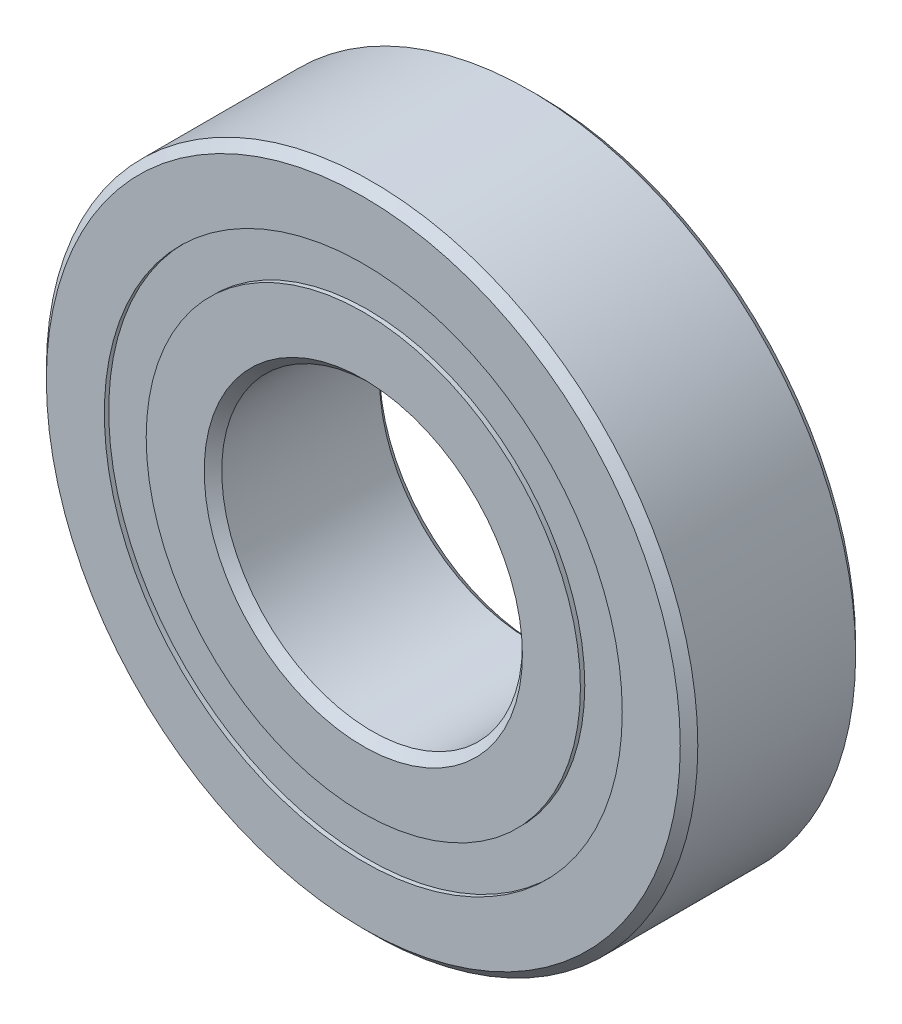
ISO-10303-21;
HEADER;
FILE_DESCRIPTION(('STEP AP214'),'2;1');
FILE_NAME('part.step','',(''),(''),'','','');
FILE_SCHEMA(('AUTOMOTIVE_DESIGN { 1 0 10303 214 1 1 1 1 }'));
ENDSEC;
DATA;
#1=APPLICATION_CONTEXT('core data for automotive mechanical design processes');
#2=APPLICATION_PROTOCOL_DEFINITION('international standard','automotive_design',2000,#1);
#3=PRODUCT_CONTEXT('',#1,'mechanical');
#4=PRODUCT('Part','Part','',(#3));
#5=PRODUCT_RELATED_PRODUCT_CATEGORY('part','',(#4));
#6=PRODUCT_DEFINITION_FORMATION('','',#4);
#7=PRODUCT_DEFINITION_CONTEXT('part definition',#1,'design');
#8=PRODUCT_DEFINITION('design','',#6,#7);
#9=PRODUCT_DEFINITION_SHAPE('','',#8);
#10=(LENGTH_UNIT() NAMED_UNIT(*) SI_UNIT(.MILLI.,.METRE.));
#11=(NAMED_UNIT(*) PLANE_ANGLE_UNIT() SI_UNIT($,.RADIAN.));
#12=(NAMED_UNIT(*) SI_UNIT($,.STERADIAN.) SOLID_ANGLE_UNIT());
#13=UNCERTAINTY_MEASURE_WITH_UNIT(LENGTH_MEASURE(1.E-05),#10,'distance_accuracy_value','');
#14=(GEOMETRIC_REPRESENTATION_CONTEXT(3) GLOBAL_UNCERTAINTY_ASSIGNED_CONTEXT((#13)) GLOBAL_UNIT_ASSIGNED_CONTEXT((#10,
#11,#12)) REPRESENTATION_CONTEXT('',''));
#15=CARTESIAN_POINT('',(0.,0.,0.));
#16=DIRECTION('',(0.,0.,1.));
#17=DIRECTION('',(1.,0.,0.));
#18=AXIS2_PLACEMENT_3D('',#15,#16,#17);
#19=CARTESIAN_POINT('',(0.,15.08125,0.));
#20=DIRECTION('',(0.,1.,0.));
#21=DIRECTION('',(0.,0.,-1.));
#22=AXIS2_PLACEMENT_3D('',#19,#20,#21);
#23=SPHERICAL_SURFACE('',#22,2.80284955168796);
#24=CARTESIAN_POINT('',(0.,12.278400448312,0.));
#25=VERTEX_POINT('',#24);
#26=VERTEX_LOOP('',#25);
#27=FACE_BOUND('',#26,.T.);
#28=CARTESIAN_POINT('',(0.,17.884099551688,0.));
#29=VERTEX_POINT('',#28);
#30=VERTEX_LOOP('',#29);
#31=FACE_BOUND('',#30,.T.);
#32=ADVANCED_FACE('P0_F15',(#27,#31),#23,.T.);
#33=CLOSED_SHELL('',(#32));
#34=MANIFOLD_SOLID_BREP('P0_B1',#33);
#35=CARTESIAN_POINT('',(0.,0.,5.55625));
#36=DIRECTION('',(0.,0.,1.));
#37=DIRECTION('',(1.,0.,0.));
#38=AXIS2_PLACEMENT_3D('',#35,#36,#37);
#39=CYLINDRICAL_SURFACE('',#38,13.7554258241758);
#40=CARTESIAN_POINT('',(0.,0.,-2.80284955168796));
#41=DIRECTION('',(0.,0.,1.));
#42=DIRECTION('',(1.,0.,0.));
#43=AXIS2_PLACEMENT_3D('',#40,#41,#42);
#44=CIRCLE('',#43,13.7554258241758);
#45=CARTESIAN_POINT('',(13.7554258241758,0.,-2.80284955168796));
#46=VERTEX_POINT('',#45);
#47=EDGE_CURVE('P1_E26',#46,#46,#44,.T.);
#48=ORIENTED_EDGE('',*,*,#47,.T.);
#49=EDGE_LOOP('',(#48));
#50=FACE_BOUND('',#49,.T.);
#51=CARTESIAN_POINT('',(0.,0.,-5.2784375));
#52=DIRECTION('',(0.,0.,1.));
#53=DIRECTION('',(1.,0.,0.));
#54=AXIS2_PLACEMENT_3D('',#51,#52,#53);
#55=CIRCLE('',#54,13.7554258241758);
#56=CARTESIAN_POINT('',(13.7554258241758,0.,-5.2784375));
#57=VERTEX_POINT('',#56);
#58=EDGE_CURVE('P1_E17',#57,#57,#55,.F.);
#59=ORIENTED_EDGE('',*,*,#58,.T.);
#60=EDGE_LOOP('',(#59));
#61=FACE_BOUND('',#60,.T.);
#62=ADVANCED_FACE('P1_F14',(#50,#61),#39,.F.);
#63=CARTESIAN_POINT('',(0.,16.4070741758242,-5.2784375));
#64=DIRECTION('',(0.,0.,1.));
#65=DIRECTION('',(1.,0.,0.));
#66=AXIS2_PLACEMENT_3D('',#63,#64,#65);
#67=PLANE('',#66);
#68=ORIENTED_EDGE('',*,*,#58,.F.);
#69=EDGE_LOOP('',(#68));
#70=FACE_BOUND('',#69,.T.);
#71=CARTESIAN_POINT('',(0.,0.,-5.2784375));
#72=DIRECTION('',(0.,0.,1.));
#73=DIRECTION('',(1.,0.,0.));
#74=AXIS2_PLACEMENT_3D('',#71,#72,#73);
#75=CIRCLE('',#74,16.4070741758242);
#76=CARTESIAN_POINT('',(16.4070741758242,0.,-5.2784375));
#77=VERTEX_POINT('',#76);
#78=EDGE_CURVE('P1_E21',#77,#77,#75,.T.);
#79=ORIENTED_EDGE('',*,*,#78,.F.);
#80=EDGE_LOOP('',(#79));
#81=FACE_BOUND('',#80,.T.);
#82=ADVANCED_FACE('P1_F35',(#70,#81),#67,.F.);
#83=CARTESIAN_POINT('',(0.,16.4070741758242,-2.80284955168796));
#84=DIRECTION('',(0.,0.,-1.));
#85=DIRECTION('',(-1.,0.,0.));
#86=AXIS2_PLACEMENT_3D('',#83,#84,#85);
#87=PLANE('',#86);
#88=ORIENTED_EDGE('',*,*,#47,.F.);
#89=EDGE_LOOP('',(#88));
#90=FACE_BOUND('',#89,.T.);
#91=CARTESIAN_POINT('',(0.,0.,-2.80284955168796));
#92=DIRECTION('',(0.,0.,1.));
#93=DIRECTION('',(1.,0.,0.));
#94=AXIS2_PLACEMENT_3D('',#91,#92,#93);
#95=CIRCLE('',#94,16.4070741758242);
#96=CARTESIAN_POINT('',(16.4070741758242,0.,-2.80284955168796));
#97=VERTEX_POINT('',#96);
#98=EDGE_CURVE('P1_E10',#97,#97,#95,.F.);
#99=ORIENTED_EDGE('',*,*,#98,.F.);
#100=EDGE_LOOP('',(#99));
#101=FACE_BOUND('',#100,.T.);
#102=ADVANCED_FACE('P1_F38',(#90,#101),#87,.F.);
#103=CARTESIAN_POINT('',(0.,0.,5.55625));
#104=DIRECTION('',(0.,0.,1.));
#105=DIRECTION('',(1.,0.,0.));
#106=AXIS2_PLACEMENT_3D('',#103,#104,#105);
#107=CYLINDRICAL_SURFACE('',#106,16.4070741758242);
#108=ORIENTED_EDGE('',*,*,#98,.T.);
#109=EDGE_LOOP('',(#108));
#110=FACE_BOUND('',#109,.T.);
#111=ORIENTED_EDGE('',*,*,#78,.T.);
#112=EDGE_LOOP('',(#111));
#113=FACE_BOUND('',#112,.T.);
#114=ADVANCED_FACE('P1_F41',(#110,#113),#107,.T.);
#115=CLOSED_SHELL('',(#62,#82,#102,#114));
#116=MANIFOLD_SOLID_BREP('P1_B1',#115);
#117=CARTESIAN_POINT('',(0.,0.,5.55625));
#118=DIRECTION('',(0.,0.,1.));
#119=DIRECTION('',(1.,0.,0.));
#120=AXIS2_PLACEMENT_3D('',#117,#118,#119);
#121=CYLINDRICAL_SURFACE('',#120,13.7554258241758);
#122=CARTESIAN_POINT('',(0.,0.,5.2784375));
#123=DIRECTION('',(0.,0.,1.));
#124=DIRECTION('',(1.,0.,0.));
#125=AXIS2_PLACEMENT_3D('',#122,#123,#124);
#126=CIRCLE('',#125,13.7554258241758);
#127=CARTESIAN_POINT('',(13.7554258241758,0.,5.2784375));
#128=VERTEX_POINT('',#127);
#129=EDGE_CURVE('P2_E26',#128,#128,#126,.T.);
#130=ORIENTED_EDGE('',*,*,#129,.T.);
#131=EDGE_LOOP('',(#130));
#132=FACE_BOUND('',#131,.T.);
#133=CARTESIAN_POINT('',(0.,0.,2.80284955168796));
#134=DIRECTION('',(0.,0.,1.));
#135=DIRECTION('',(1.,0.,0.));
#136=AXIS2_PLACEMENT_3D('',#133,#134,#135);
#137=CIRCLE('',#136,13.7554258241758);
#138=CARTESIAN_POINT('',(13.7554258241758,0.,2.80284955168796));
#139=VERTEX_POINT('',#138);
#140=EDGE_CURVE('P2_E17',#139,#139,#137,.F.);
#141=ORIENTED_EDGE('',*,*,#140,.T.);
#142=EDGE_LOOP('',(#141));
#143=FACE_BOUND('',#142,.T.);
#144=ADVANCED_FACE('P2_F14',(#132,#143),#121,.F.);
#145=CARTESIAN_POINT('',(0.,16.4070741758242,2.80284955168796));
#146=DIRECTION('',(0.,0.,1.));
#147=DIRECTION('',(1.,0.,0.));
#148=AXIS2_PLACEMENT_3D('',#145,#146,#147);
#149=PLANE('',#148);
#150=ORIENTED_EDGE('',*,*,#140,.F.);
#151=EDGE_LOOP('',(#150));
#152=FACE_BOUND('',#151,.T.);
#153=CARTESIAN_POINT('',(0.,0.,2.80284955168796));
#154=DIRECTION('',(0.,0.,1.));
#155=DIRECTION('',(1.,0.,0.));
#156=AXIS2_PLACEMENT_3D('',#153,#154,#155);
#157=CIRCLE('',#156,16.4070741758242);
#158=CARTESIAN_POINT('',(16.4070741758242,0.,2.80284955168796));
#159=VERTEX_POINT('',#158);
#160=EDGE_CURVE('P2_E21',#159,#159,#157,.T.);
#161=ORIENTED_EDGE('',*,*,#160,.F.);
#162=EDGE_LOOP('',(#161));
#163=FACE_BOUND('',#162,.T.);
#164=ADVANCED_FACE('P2_F35',(#152,#163),#149,.F.);
#165=CARTESIAN_POINT('',(0.,16.4070741758242,5.2784375));
#166=DIRECTION('',(0.,0.,-1.));
#167=DIRECTION('',(-1.,0.,0.));
#168=AXIS2_PLACEMENT_3D('',#165,#166,#167);
#169=PLANE('',#168);
#170=ORIENTED_EDGE('',*,*,#129,.F.);
#171=EDGE_LOOP('',(#170));
#172=FACE_BOUND('',#171,.T.);
#173=CARTESIAN_POINT('',(0.,0.,5.2784375));
#174=DIRECTION('',(0.,0.,1.));
#175=DIRECTION('',(1.,0.,0.));
#176=AXIS2_PLACEMENT_3D('',#173,#174,#175);
#177=CIRCLE('',#176,16.4070741758242);
#178=CARTESIAN_POINT('',(16.4070741758242,0.,5.2784375));
#179=VERTEX_POINT('',#178);
#180=EDGE_CURVE('P2_E10',#179,#179,#177,.F.);
#181=ORIENTED_EDGE('',*,*,#180,.F.);
#182=EDGE_LOOP('',(#181));
#183=FACE_BOUND('',#182,.T.);
#184=ADVANCED_FACE('P2_F38',(#172,#183),#169,.F.);
#185=CARTESIAN_POINT('',(0.,0.,5.55625));
#186=DIRECTION('',(0.,0.,1.));
#187=DIRECTION('',(1.,0.,0.));
#188=AXIS2_PLACEMENT_3D('',#185,#186,#187);
#189=CYLINDRICAL_SURFACE('',#188,16.4070741758242);
#190=ORIENTED_EDGE('',*,*,#180,.T.);
#191=EDGE_LOOP('',(#190));
#192=FACE_BOUND('',#191,.T.);
#193=ORIENTED_EDGE('',*,*,#160,.T.);
#194=EDGE_LOOP('',(#193));
#195=FACE_BOUND('',#194,.T.);
#196=ADVANCED_FACE('P2_F41',(#192,#195),#189,.T.);
#197=CLOSED_SHELL('',(#144,#164,#184,#196));
#198=MANIFOLD_SOLID_BREP('P2_B1',#197);
#199=CARTESIAN_POINT('',(0.,0.,0.));
#200=DIRECTION('',(0.,0.,1.));
#201=DIRECTION('',(1.,0.,0.));
#202=AXIS2_PLACEMENT_3D('',#199,#200,#201);
#203=TOROIDAL_SURFACE('',#202,15.08125,2.80284955168796);
#204=CARTESIAN_POINT('',(0.,0.,-2.46944444444445));
#205=DIRECTION('',(0.,0.,1.));
#206=DIRECTION('',(1.,0.,0.));
#207=AXIS2_PLACEMENT_3D('',#204,#205,#206);
#208=CIRCLE('',#207,13.7554258241758);
#209=CARTESIAN_POINT('',(13.7554258241758,0.,-2.46944444444445));
#210=VERTEX_POINT('',#209);
#211=EDGE_CURVE('P3_E37',#210,#210,#208,.F.);
#212=ORIENTED_EDGE('',*,*,#211,.F.);
#213=EDGE_LOOP('',(#212));
#214=FACE_BOUND('',#213,.T.);
#215=CARTESIAN_POINT('',(0.,0.,2.46944444444444));
#216=DIRECTION('',(0.,0.,1.));
#217=DIRECTION('',(1.,0.,0.));
#218=AXIS2_PLACEMENT_3D('',#215,#216,#217);
#219=CIRCLE('',#218,13.7554258241758);
#220=CARTESIAN_POINT('',(13.7554258241758,0.,2.46944444444444));
#221=VERTEX_POINT('',#220);
#222=EDGE_CURVE('P3_E34',#221,#221,#219,.T.);
#223=ORIENTED_EDGE('',*,*,#222,.F.);
#224=EDGE_LOOP('',(#223));
#225=FACE_BOUND('',#224,.T.);
#226=ADVANCED_FACE('P3_F14',(#214,#225),#203,.F.);
#227=CARTESIAN_POINT('',(0.,0.,5.55625));
#228=DIRECTION('',(0.,0.,1.));
#229=DIRECTION('',(1.,0.,0.));
#230=AXIS2_PLACEMENT_3D('',#227,#228,#229);
#231=CYLINDRICAL_SURFACE('',#230,13.7554258241758);
#232=ORIENTED_EDGE('',*,*,#211,.T.);
#233=EDGE_LOOP('',(#232));
#234=FACE_BOUND('',#233,.T.);
#235=CARTESIAN_POINT('',(0.,0.,-5.55625));
#236=DIRECTION('',(0.,0.,1.));
#237=DIRECTION('',(1.,0.,0.));
#238=AXIS2_PLACEMENT_3D('',#235,#236,#237);
#239=CIRCLE('',#238,13.7554258241758);
#240=CARTESIAN_POINT('',(13.7554258241758,0.,-5.55625));
#241=VERTEX_POINT('',#240);
#242=EDGE_CURVE('P3_E18',#241,#241,#239,.T.);
#243=ORIENTED_EDGE('',*,*,#242,.T.);
#244=EDGE_LOOP('',(#243));
#245=FACE_BOUND('',#244,.T.);
#246=ADVANCED_FACE('P3_F56',(#234,#245),#231,.T.);
#247=CARTESIAN_POINT('',(0.,0.,5.55625));
#248=DIRECTION('',(0.,0.,1.));
#249=DIRECTION('',(1.,0.,0.));
#250=AXIS2_PLACEMENT_3D('',#247,#248,#249);
#251=CYLINDRICAL_SURFACE('',#250,13.7554258241758);
#252=CARTESIAN_POINT('',(0.,0.,5.55625));
#253=DIRECTION('',(0.,0.,1.));
#254=DIRECTION('',(1.,0.,0.));
#255=AXIS2_PLACEMENT_3D('',#252,#253,#254);
#256=CIRCLE('',#255,13.7554258241758);
#257=CARTESIAN_POINT('',(13.7554258241758,0.,5.55625));
#258=VERTEX_POINT('',#257);
#259=EDGE_CURVE('P3_E49',#258,#258,#256,.F.);
#260=ORIENTED_EDGE('',*,*,#259,.T.);
#261=EDGE_LOOP('',(#260));
#262=FACE_BOUND('',#261,.T.);
#263=ORIENTED_EDGE('',*,*,#222,.T.);
#264=EDGE_LOOP('',(#263));
#265=FACE_BOUND('',#264,.T.);
#266=ADVANCED_FACE('P3_F61',(#262,#265),#251,.T.);
#267=CARTESIAN_POINT('',(0.,10.080625,-5.55625));
#268=DIRECTION('',(0.,0.,1.));
#269=DIRECTION('',(1.,0.,0.));
#270=AXIS2_PLACEMENT_3D('',#267,#268,#269);
#271=PLANE('',#270);
#272=CARTESIAN_POINT('',(0.,0.,-5.55625));
#273=DIRECTION('',(0.,0.,-1.));
#274=DIRECTION('',(0.,1.,0.));
#275=AXIS2_PLACEMENT_3D('',#272,#273,#274);
#276=CIRCLE('',#275,10.080625);
#277=CARTESIAN_POINT('',(0.,10.080625,-5.55625));
#278=VERTEX_POINT('',#277);
#279=EDGE_CURVE('P3_E47',#278,#278,#276,.F.);
#280=ORIENTED_EDGE('',*,*,#279,.T.);
#281=EDGE_LOOP('',(#280));
#282=FACE_BOUND('',#281,.T.);
#283=ORIENTED_EDGE('',*,*,#242,.F.);
#284=EDGE_LOOP('',(#283));
#285=FACE_BOUND('',#284,.T.);
#286=ADVANCED_FACE('P3_F58',(#282,#285),#271,.F.);
#287=CARTESIAN_POINT('',(0.,13.7554258241758,5.55625));
#288=DIRECTION('',(0.,0.,-1.));
#289=DIRECTION('',(-1.,0.,0.));
#290=AXIS2_PLACEMENT_3D('',#287,#288,#289);
#291=PLANE('',#290);
#292=CARTESIAN_POINT('',(0.,0.,5.55625));
#293=DIRECTION('',(0.,0.,1.));
#294=DIRECTION('',(1.,0.,0.));
#295=AXIS2_PLACEMENT_3D('',#292,#293,#294);
#296=CIRCLE('',#295,10.080625);
#297=CARTESIAN_POINT('',(10.080625,0.,5.55625));
#298=VERTEX_POINT('',#297);
#299=EDGE_CURVE('P3_E27',#298,#298,#296,.F.);
#300=ORIENTED_EDGE('',*,*,#299,.T.);
#301=EDGE_LOOP('',(#300));
#302=FACE_BOUND('',#301,.T.);
#303=ORIENTED_EDGE('',*,*,#259,.F.);
#304=EDGE_LOOP('',(#303));
#305=FACE_BOUND('',#304,.T.);
#306=ADVANCED_FACE('P3_F60',(#302,#305),#291,.F.);
#307=CARTESIAN_POINT('',(0.,0.,-5.55625));
#308=DIRECTION('',(0.,0.,-1.));
#309=DIRECTION('',(0.,1.,0.));
#310=AXIS2_PLACEMENT_3D('',#307,#308,#309);
#311=CONICAL_SURFACE('',#310,10.080625,0.785398163397445);
#312=ORIENTED_EDGE('',*,*,#279,.F.);
#313=EDGE_LOOP('',(#312));
#314=FACE_BOUND('',#313,.T.);
#315=CARTESIAN_POINT('',(0.,0.,-5.000625));
#316=DIRECTION('',(0.,0.,1.));
#317=DIRECTION('',(1.,0.,0.));
#318=AXIS2_PLACEMENT_3D('',#315,#316,#317);
#319=CIRCLE('',#318,9.525);
#320=CARTESIAN_POINT('',(9.525,0.,-5.000625));
#321=VERTEX_POINT('',#320);
#322=EDGE_CURVE('P3_E22',#321,#321,#319,.T.);
#323=ORIENTED_EDGE('',*,*,#322,.T.);
#324=EDGE_LOOP('',(#323));
#325=FACE_BOUND('',#324,.T.);
#326=ADVANCED_FACE('P3_F69',(#314,#325),#311,.F.);
#327=CARTESIAN_POINT('',(0.,0.,5.55625));
#328=DIRECTION('',(0.,0.,1.));
#329=DIRECTION('',(1.,0.,0.));
#330=AXIS2_PLACEMENT_3D('',#327,#328,#329);
#331=CONICAL_SURFACE('',#330,10.080625,0.785398163397455);
#332=ORIENTED_EDGE('',*,*,#299,.F.);
#333=EDGE_LOOP('',(#332));
#334=FACE_BOUND('',#333,.T.);
#335=CARTESIAN_POINT('',(0.,0.,5.000625));
#336=DIRECTION('',(0.,0.,1.));
#337=DIRECTION('',(1.,0.,0.));
#338=AXIS2_PLACEMENT_3D('',#335,#336,#337);
#339=CIRCLE('',#338,9.525);
#340=CARTESIAN_POINT('',(9.525,0.,5.000625));
#341=VERTEX_POINT('',#340);
#342=EDGE_CURVE('P3_E10',#341,#341,#339,.F.);
#343=ORIENTED_EDGE('',*,*,#342,.T.);
#344=EDGE_LOOP('',(#343));
#345=FACE_BOUND('',#344,.T.);
#346=ADVANCED_FACE('P3_F75',(#334,#345),#331,.F.);
#347=CARTESIAN_POINT('',(0.,0.,5.55625));
#348=DIRECTION('',(0.,0.,1.));
#349=DIRECTION('',(1.,0.,0.));
#350=AXIS2_PLACEMENT_3D('',#347,#348,#349);
#351=CYLINDRICAL_SURFACE('',#350,9.525);
#352=ORIENTED_EDGE('',*,*,#342,.F.);
#353=EDGE_LOOP('',(#352));
#354=FACE_BOUND('',#353,.T.);
#355=ORIENTED_EDGE('',*,*,#322,.F.);
#356=EDGE_LOOP('',(#355));
#357=FACE_BOUND('',#356,.T.);
#358=ADVANCED_FACE('P3_F73',(#354,#357),#351,.F.);
#359=CLOSED_SHELL('',(#226,#246,#266,#286,#306,#326,#346,#358));
#360=MANIFOLD_SOLID_BREP('P3_B1',#359);
#361=CARTESIAN_POINT('',(13.0607456208241,7.54062499999997,0.));
#362=DIRECTION('',(0.86602540378444,0.499999999999998,0.));
#363=DIRECTION('',(0.,0.,-1.));
#364=AXIS2_PLACEMENT_3D('',#361,#362,#363);
#365=SPHERICAL_SURFACE('',#364,2.80284955168796);
#366=CARTESIAN_POINT('',(10.6334067060765,6.139200224156,0.));
#367=VERTEX_POINT('',#366);
#368=VERTEX_LOOP('',#367);
#369=FACE_BOUND('',#368,.T.);
#370=CARTESIAN_POINT('',(15.4880845355717,8.94204977584395,0.));
#371=VERTEX_POINT('',#370);
#372=VERTEX_LOOP('',#371);
#373=FACE_BOUND('',#372,.T.);
#374=ADVANCED_FACE('P4_F15',(#369,#373),#365,.T.);
#375=CLOSED_SHELL('',(#374));
#376=MANIFOLD_SOLID_BREP('P4_B1',#375);
#377=CARTESIAN_POINT('',(-7.54062499999982,13.0607456208242,0.));
#378=DIRECTION('',(-0.499999999999989,0.866025403784445,0.));
#379=DIRECTION('',(0.,0.,-1.));
#380=AXIS2_PLACEMENT_3D('',#377,#378,#379);
#381=SPHERICAL_SURFACE('',#380,2.80284955168796);
#382=CARTESIAN_POINT('',(-6.13920022415587,10.6334067060765,0.));
#383=VERTEX_POINT('',#382);
#384=VERTEX_LOOP('',#383);
#385=FACE_BOUND('',#384,.T.);
#386=CARTESIAN_POINT('',(-8.94204977584377,15.4880845355718,0.));
#387=VERTEX_POINT('',#386);
#388=VERTEX_LOOP('',#387);
#389=FACE_BOUND('',#388,.T.);
#390=ADVANCED_FACE('P5_F15',(#385,#389),#381,.T.);
#391=CLOSED_SHELL('',(#390));
#392=MANIFOLD_SOLID_BREP('P5_B1',#391);
#393=CARTESIAN_POINT('',(7.54062500000002,13.0607456208241,0.));
#394=DIRECTION('',(0.500000000000001,0.866025403784438,0.));
#395=DIRECTION('',(0.,0.,-1.));
#396=AXIS2_PLACEMENT_3D('',#393,#394,#395);
#397=SPHERICAL_SURFACE('',#396,2.80284955168796);
#398=CARTESIAN_POINT('',(6.13920022415604,10.6334067060765,0.));
#399=VERTEX_POINT('',#398);
#400=VERTEX_LOOP('',#399);
#401=FACE_BOUND('',#400,.T.);
#402=CARTESIAN_POINT('',(8.94204977584401,15.4880845355716,0.));
#403=VERTEX_POINT('',#402);
#404=VERTEX_LOOP('',#403);
#405=FACE_BOUND('',#404,.T.);
#406=ADVANCED_FACE('P6_F15',(#401,#405),#397,.T.);
#407=CLOSED_SHELL('',(#406));
#408=MANIFOLD_SOLID_BREP('P6_B1',#407);
#409=CARTESIAN_POINT('',(-7.5406250000001,-13.060745620824,0.));
#410=DIRECTION('',(-0.500000000000008,-0.866025403784434,0.));
#411=DIRECTION('',(0.,0.,-1.));
#412=AXIS2_PLACEMENT_3D('',#409,#410,#411);
#413=SPHERICAL_SURFACE('',#412,2.80284955168796);
#414=CARTESIAN_POINT('',(-6.1392002241561,-10.6334067060764,0.));
#415=VERTEX_POINT('',#414);
#416=VERTEX_LOOP('',#415);
#417=FACE_BOUND('',#416,.T.);
#418=CARTESIAN_POINT('',(-8.9420497758441,-15.4880845355716,0.));
#419=VERTEX_POINT('',#418);
#420=VERTEX_LOOP('',#419);
#421=FACE_BOUND('',#420,.T.);
#422=ADVANCED_FACE('P7_F15',(#417,#421),#413,.T.);
#423=CLOSED_SHELL('',(#422));
#424=MANIFOLD_SOLID_BREP('P7_B1',#423);
#425=CARTESIAN_POINT('',(15.08125,0.,0.));
#426=DIRECTION('',(1.,0.,0.));
#427=DIRECTION('',(0.,0.,-1.));
#428=AXIS2_PLACEMENT_3D('',#425,#426,#427);
#429=SPHERICAL_SURFACE('',#428,2.80284955168796);
#430=CARTESIAN_POINT('',(12.278400448312,0.,0.));
#431=VERTEX_POINT('',#430);
#432=VERTEX_LOOP('',#431);
#433=FACE_BOUND('',#432,.T.);
#434=CARTESIAN_POINT('',(17.884099551688,0.,0.));
#435=VERTEX_POINT('',#434);
#436=VERTEX_LOOP('',#435);
#437=FACE_BOUND('',#436,.T.);
#438=ADVANCED_FACE('P8_F15',(#433,#437),#429,.T.);
#439=CLOSED_SHELL('',(#438));
#440=MANIFOLD_SOLID_BREP('P8_B1',#439);
#441=CARTESIAN_POINT('',(7.54062499999992,-13.0607456208241,0.));
#442=DIRECTION('',(0.499999999999995,-0.866025403784442,0.));
#443=DIRECTION('',(0.,0.,-1.));
#444=AXIS2_PLACEMENT_3D('',#441,#442,#443);
#445=SPHERICAL_SURFACE('',#444,2.80284955168796);
#446=CARTESIAN_POINT('',(6.13920022415596,-10.6334067060765,0.));
#447=VERTEX_POINT('',#446);
#448=VERTEX_LOOP('',#447);
#449=FACE_BOUND('',#448,.T.);
#450=CARTESIAN_POINT('',(8.94204977584389,-15.4880845355717,0.));
#451=VERTEX_POINT('',#450);
#452=VERTEX_LOOP('',#451);
#453=FACE_BOUND('',#452,.T.);
#454=ADVANCED_FACE('P9_F15',(#449,#453),#445,.T.);
#455=CLOSED_SHELL('',(#454));
#456=MANIFOLD_SOLID_BREP('P9_B1',#455);
#457=CARTESIAN_POINT('',(0.,0.,0.));
#458=DIRECTION('',(0.,0.,1.));
#459=DIRECTION('',(1.,0.,0.));
#460=AXIS2_PLACEMENT_3D('',#457,#458,#459);
#461=TOROIDAL_SURFACE('',#460,15.08125,2.80284955168796);
#462=CARTESIAN_POINT('',(0.,0.,2.46944444444444));
#463=DIRECTION('',(0.,0.,1.));
#464=DIRECTION('',(1.,0.,0.));
#465=AXIS2_PLACEMENT_3D('',#462,#463,#464);
#466=CIRCLE('',#465,16.4070741758242);
#467=CARTESIAN_POINT('',(16.4070741758242,0.,2.46944444444444));
#468=VERTEX_POINT('',#467);
#469=EDGE_CURVE('P10_E34',#468,#468,#466,.T.);
#470=ORIENTED_EDGE('',*,*,#469,.T.);
#471=EDGE_LOOP('',(#470));
#472=FACE_BOUND('',#471,.T.);
#473=CARTESIAN_POINT('',(0.,0.,-2.46944444444444));
#474=DIRECTION('',(0.,0.,1.));
#475=DIRECTION('',(1.,0.,0.));
#476=AXIS2_PLACEMENT_3D('',#473,#474,#475);
#477=CIRCLE('',#476,16.4070741758242);
#478=CARTESIAN_POINT('',(16.4070741758242,0.,-2.46944444444444));
#479=VERTEX_POINT('',#478);
#480=EDGE_CURVE('P10_E37',#479,#479,#477,.F.);
#481=ORIENTED_EDGE('',*,*,#480,.T.);
#482=EDGE_LOOP('',(#481));
#483=FACE_BOUND('',#482,.T.);
#484=ADVANCED_FACE('P10_F14',(#472,#483),#461,.F.);
#485=CARTESIAN_POINT('',(0.,0.,5.55625));
#486=DIRECTION('',(0.,0.,1.));
#487=DIRECTION('',(1.,0.,0.));
#488=AXIS2_PLACEMENT_3D('',#485,#486,#487);
#489=CYLINDRICAL_SURFACE('',#488,16.4070741758242);
#490=ORIENTED_EDGE('',*,*,#480,.F.);
#491=EDGE_LOOP('',(#490));
#492=FACE_BOUND('',#491,.T.);
#493=CARTESIAN_POINT('',(0.,0.,-5.55625));
#494=DIRECTION('',(0.,0.,1.));
#495=DIRECTION('',(1.,0.,0.));
#496=AXIS2_PLACEMENT_3D('',#493,#494,#495);
#497=CIRCLE('',#496,16.4070741758242);
#498=CARTESIAN_POINT('',(16.4070741758242,0.,-5.55625));
#499=VERTEX_POINT('',#498);
#500=EDGE_CURVE('P10_E18',#499,#499,#497,.F.);
#501=ORIENTED_EDGE('',*,*,#500,.T.);
#502=EDGE_LOOP('',(#501));
#503=FACE_BOUND('',#502,.T.);
#504=ADVANCED_FACE('P10_F56',(#492,#503),#489,.F.);
#505=CARTESIAN_POINT('',(0.,0.,5.55625));
#506=DIRECTION('',(0.,0.,1.));
#507=DIRECTION('',(1.,0.,0.));
#508=AXIS2_PLACEMENT_3D('',#505,#506,#507);
#509=CYLINDRICAL_SURFACE('',#508,16.4070741758242);
#510=CARTESIAN_POINT('',(0.,0.,5.55625));
#511=DIRECTION('',(0.,0.,1.));
#512=DIRECTION('',(1.,0.,0.));
#513=AXIS2_PLACEMENT_3D('',#510,#511,#512);
#514=CIRCLE('',#513,16.4070741758242);
#515=CARTESIAN_POINT('',(16.4070741758242,0.,5.55625));
#516=VERTEX_POINT('',#515);
#517=EDGE_CURVE('P10_E49',#516,#516,#514,.T.);
#518=ORIENTED_EDGE('',*,*,#517,.T.);
#519=EDGE_LOOP('',(#518));
#520=FACE_BOUND('',#519,.T.);
#521=ORIENTED_EDGE('',*,*,#469,.F.);
#522=EDGE_LOOP('',(#521));
#523=FACE_BOUND('',#522,.T.);
#524=ADVANCED_FACE('P10_F62',(#520,#523),#509,.F.);
#525=CARTESIAN_POINT('',(0.,20.081875,-5.55625));
#526=DIRECTION('',(0.,0.,1.));
#527=DIRECTION('',(1.,0.,0.));
#528=AXIS2_PLACEMENT_3D('',#525,#526,#527);
#529=PLANE('',#528);
#530=ORIENTED_EDGE('',*,*,#500,.F.);
#531=EDGE_LOOP('',(#530));
#532=FACE_BOUND('',#531,.T.);
#533=CARTESIAN_POINT('',(0.,0.,-5.55625));
#534=DIRECTION('',(0.,0.,1.));
#535=DIRECTION('',(1.,0.,0.));
#536=AXIS2_PLACEMENT_3D('',#533,#534,#535);
#537=CIRCLE('',#536,20.081875);
#538=CARTESIAN_POINT('',(20.081875,0.,-5.55625));
#539=VERTEX_POINT('',#538);
#540=EDGE_CURVE('P10_E47',#539,#539,#537,.T.);
#541=ORIENTED_EDGE('',*,*,#540,.F.);
#542=EDGE_LOOP('',(#541));
#543=FACE_BOUND('',#542,.T.);
#544=ADVANCED_FACE('P10_F58',(#532,#543),#529,.F.);
#545=CARTESIAN_POINT('',(0.,20.081875,5.55625));
#546=DIRECTION('',(0.,0.,-1.));
#547=DIRECTION('',(-1.,0.,0.));
#548=AXIS2_PLACEMENT_3D('',#545,#546,#547);
#549=PLANE('',#548);
#550=ORIENTED_EDGE('',*,*,#517,.F.);
#551=EDGE_LOOP('',(#550));
#552=FACE_BOUND('',#551,.T.);
#553=CARTESIAN_POINT('',(0.,0.,5.55625));
#554=DIRECTION('',(0.,0.,-1.));
#555=DIRECTION('',(-1.,0.,0.));
#556=AXIS2_PLACEMENT_3D('',#553,#554,#555);
#557=CIRCLE('',#556,20.081875);
#558=CARTESIAN_POINT('',(-20.081875,0.,5.55625));
#559=VERTEX_POINT('',#558);
#560=EDGE_CURVE('P10_E27',#559,#559,#557,.T.);
#561=ORIENTED_EDGE('',*,*,#560,.F.);
#562=EDGE_LOOP('',(#561));
#563=FACE_BOUND('',#562,.T.);
#564=ADVANCED_FACE('P10_F61',(#552,#563),#549,.F.);
#565=CARTESIAN_POINT('',(0.,0.,-5.000625));
#566=DIRECTION('',(0.,0.,1.));
#567=DIRECTION('',(1.,0.,0.));
#568=AXIS2_PLACEMENT_3D('',#565,#566,#567);
#569=CONICAL_SURFACE('',#568,20.6375,0.785398163397446);
#570=CARTESIAN_POINT('',(0.,0.,-5.000625));
#571=DIRECTION('',(0.,0.,1.));
#572=DIRECTION('',(1.,0.,0.));
#573=AXIS2_PLACEMENT_3D('',#570,#571,#572);
#574=CIRCLE('',#573,20.6375);
#575=CARTESIAN_POINT('',(20.6375,0.,-5.000625));
#576=VERTEX_POINT('',#575);
#577=EDGE_CURVE('P10_E22',#576,#576,#574,.T.);
#578=ORIENTED_EDGE('',*,*,#577,.F.);
#579=EDGE_LOOP('',(#578));
#580=FACE_BOUND('',#579,.T.);
#581=ORIENTED_EDGE('',*,*,#540,.T.);
#582=EDGE_LOOP('',(#581));
#583=FACE_BOUND('',#582,.T.);
#584=ADVANCED_FACE('P10_F66',(#580,#583),#569,.T.);
#585=CARTESIAN_POINT('',(0.,0.,5.000625));
#586=DIRECTION('',(0.,0.,-1.));
#587=DIRECTION('',(-1.,0.,0.));
#588=AXIS2_PLACEMENT_3D('',#585,#586,#587);
#589=CONICAL_SURFACE('',#588,20.6375,0.785398163397448);
#590=CARTESIAN_POINT('',(0.,0.,5.000625));
#591=DIRECTION('',(0.,0.,1.));
#592=DIRECTION('',(1.,0.,0.));
#593=AXIS2_PLACEMENT_3D('',#590,#591,#592);
#594=CIRCLE('',#593,20.6375);
#595=CARTESIAN_POINT('',(20.6375,0.,5.000625));
#596=VERTEX_POINT('',#595);
#597=EDGE_CURVE('P10_E10',#596,#596,#594,.F.);
#598=ORIENTED_EDGE('',*,*,#597,.F.);
#599=EDGE_LOOP('',(#598));
#600=FACE_BOUND('',#599,.T.);
#601=ORIENTED_EDGE('',*,*,#560,.T.);
#602=EDGE_LOOP('',(#601));
#603=FACE_BOUND('',#602,.T.);
#604=ADVANCED_FACE('P10_F68',(#600,#603),#589,.T.);
#605=CARTESIAN_POINT('',(0.,0.,5.55625));
#606=DIRECTION('',(0.,0.,1.));
#607=DIRECTION('',(1.,0.,0.));
#608=AXIS2_PLACEMENT_3D('',#605,#606,#607);
#609=CYLINDRICAL_SURFACE('',#608,20.6375);
#610=ORIENTED_EDGE('',*,*,#597,.T.);
#611=EDGE_LOOP('',(#610));
#612=FACE_BOUND('',#611,.T.);
#613=ORIENTED_EDGE('',*,*,#577,.T.);
#614=EDGE_LOOP('',(#613));
#615=FACE_BOUND('',#614,.T.);
#616=ADVANCED_FACE('P10_F76',(#612,#615),#609,.T.);
#617=CLOSED_SHELL('',(#484,#504,#524,#544,#564,#584,#604,#616));
#618=MANIFOLD_SOLID_BREP('P10_B1',#617);
#619=CARTESIAN_POINT('',(-13.0607456208241,-7.54062499999987,0.));
#620=DIRECTION('',(-0.866025403784443,-0.499999999999992,0.));
#621=DIRECTION('',(0.,0.,-1.));
#622=AXIS2_PLACEMENT_3D('',#619,#620,#621);
#623=SPHERICAL_SURFACE('',#622,2.80284955168796);
#624=CARTESIAN_POINT('',(-10.6334067060765,-6.13920022415592,0.));
#625=VERTEX_POINT('',#624);
#626=VERTEX_LOOP('',#625);
#627=FACE_BOUND('',#626,.T.);
#628=CARTESIAN_POINT('',(-15.4880845355717,-8.94204977584383,0.));
#629=VERTEX_POINT('',#628);
#630=VERTEX_LOOP('',#629);
#631=FACE_BOUND('',#630,.T.);
#632=ADVANCED_FACE('P11_F15',(#627,#631),#623,.T.);
#633=CLOSED_SHELL('',(#632));
#634=MANIFOLD_SOLID_BREP('P11_B1',#633);
#635=CARTESIAN_POINT('',(-13.060745620824,7.54062500000015,0.));
#636=DIRECTION('',(-0.866025403784433,0.50000000000001,0.));
#637=DIRECTION('',(0.,0.,-1.));
#638=AXIS2_PLACEMENT_3D('',#635,#636,#637);
#639=SPHERICAL_SURFACE('',#638,2.80284955168796);
#640=CARTESIAN_POINT('',(-10.6334067060764,6.13920022415614,0.));
#641=VERTEX_POINT('',#640);
#642=VERTEX_LOOP('',#641);
#643=FACE_BOUND('',#642,.T.);
#644=CARTESIAN_POINT('',(-15.4880845355716,8.94204977584416,0.));
#645=VERTEX_POINT('',#644);
#646=VERTEX_LOOP('',#645);
#647=FACE_BOUND('',#646,.T.);
#648=ADVANCED_FACE('P12_F15',(#643,#647),#639,.T.);
#649=CLOSED_SHELL('',(#648));
#650=MANIFOLD_SOLID_BREP('P12_B1',#649);
#651=CARTESIAN_POINT('',(-15.08125,1.57967708824284E-13,0.));
#652=DIRECTION('',(-1.,0.,0.));
#653=DIRECTION('',(0.,0.,-1.));
#654=AXIS2_PLACEMENT_3D('',#651,#652,#653);
#655=SPHERICAL_SURFACE('',#654,2.80284955168796);
#656=CARTESIAN_POINT('',(-12.278400448312,1.30111294072002E-13,0.));
#657=VERTEX_POINT('',#656);
#658=VERTEX_LOOP('',#657);
#659=FACE_BOUND('',#658,.T.);
#660=CARTESIAN_POINT('',(-17.884099551688,1.86167373649763E-13,0.));
#661=VERTEX_POINT('',#660);
#662=VERTEX_LOOP('',#661);
#663=FACE_BOUND('',#662,.T.);
#664=ADVANCED_FACE('P13_F15',(#659,#663),#655,.T.);
#665=CLOSED_SHELL('',(#664));
#666=MANIFOLD_SOLID_BREP('P13_B1',#665);
#667=CARTESIAN_POINT('',(13.060745620824,-7.54062500000005,0.));
#668=DIRECTION('',(0.866025403784436,-0.500000000000004,0.));
#669=DIRECTION('',(0.,0.,-1.));
#670=AXIS2_PLACEMENT_3D('',#667,#668,#669);
#671=SPHERICAL_SURFACE('',#670,2.80284955168796);
#672=CARTESIAN_POINT('',(10.6334067060764,-6.13920022415606,0.));
#673=VERTEX_POINT('',#672);
#674=VERTEX_LOOP('',#673);
#675=FACE_BOUND('',#674,.T.);
#676=CARTESIAN_POINT('',(15.4880845355716,-8.94204977584404,0.));
#677=VERTEX_POINT('',#676);
#678=VERTEX_LOOP('',#677);
#679=FACE_BOUND('',#678,.T.);
#680=ADVANCED_FACE('P14_F15',(#675,#679),#671,.T.);
#681=CLOSED_SHELL('',(#680));
#682=MANIFOLD_SOLID_BREP('P14_B1',#681);
#683=CARTESIAN_POINT('',(-1.05311805882856E-13,-15.08125,0.));
#684=DIRECTION('',(0.,-1.,0.));
#685=DIRECTION('',(0.,0.,-1.));
#686=AXIS2_PLACEMENT_3D('',#683,#684,#685);
#687=SPHERICAL_SURFACE('',#686,2.80284955168796);
#688=CARTESIAN_POINT('',(0.,-12.278400448312,0.));
#689=VERTEX_POINT('',#688);
#690=VERTEX_LOOP('',#689);
#691=FACE_BOUND('',#690,.T.);
#692=CARTESIAN_POINT('',(-1.25051571260691E-13,-17.884099551688,0.));
#693=VERTEX_POINT('',#692);
#694=VERTEX_LOOP('',#693);
#695=FACE_BOUND('',#694,.T.);
#696=ADVANCED_FACE('P15_F15',(#691,#695),#687,.T.);
#697=CLOSED_SHELL('',(#696));
#698=MANIFOLD_SOLID_BREP('P15_B1',#697);
#699=ADVANCED_BREP_SHAPE_REPRESENTATION('',(#18,#34,#116,#198,#360,#376,#392,#408,#424,#440,
#456,#618,#634,#650,#666,#682,#698),#14);
#700=SHAPE_DEFINITION_REPRESENTATION(#9,#699);
ENDSEC;
END-ISO-10303-21;
